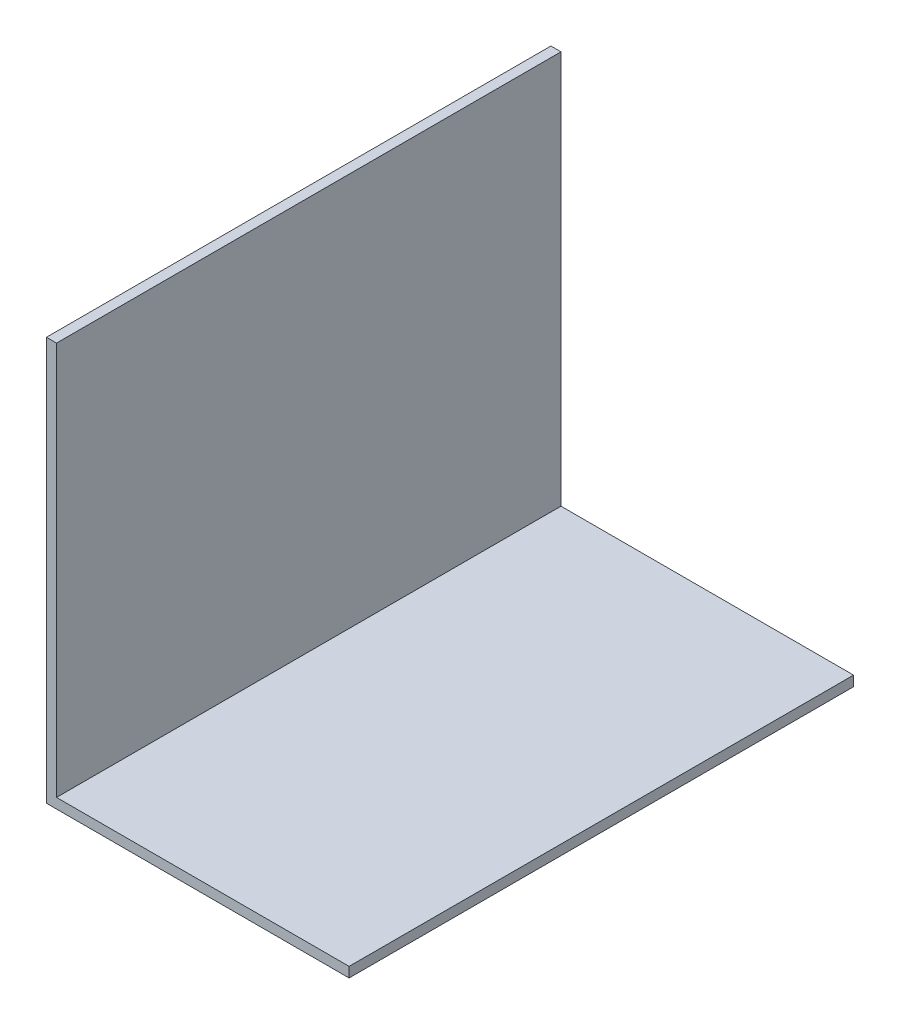
ISO-10303-21;
HEADER;
FILE_DESCRIPTION(('STEP AP214'),'2;1');
FILE_NAME('part.step','',(''),(''),'','','');
FILE_SCHEMA(('AUTOMOTIVE_DESIGN { 1 0 10303 214 1 1 1 1 }'));
ENDSEC;
DATA;
#1=APPLICATION_CONTEXT('core data for automotive mechanical design processes');
#2=APPLICATION_PROTOCOL_DEFINITION('international standard','automotive_design',2000,#1);
#3=PRODUCT_CONTEXT('',#1,'mechanical');
#4=PRODUCT('Part','Part','',(#3));
#5=PRODUCT_RELATED_PRODUCT_CATEGORY('part','',(#4));
#6=PRODUCT_DEFINITION_FORMATION('','',#4);
#7=PRODUCT_DEFINITION_CONTEXT('part definition',#1,'design');
#8=PRODUCT_DEFINITION('design','',#6,#7);
#9=PRODUCT_DEFINITION_SHAPE('','',#8);
#10=(LENGTH_UNIT() NAMED_UNIT(*) SI_UNIT(.MILLI.,.METRE.));
#11=(NAMED_UNIT(*) PLANE_ANGLE_UNIT() SI_UNIT($,.RADIAN.));
#12=(NAMED_UNIT(*) SI_UNIT($,.STERADIAN.) SOLID_ANGLE_UNIT());
#13=UNCERTAINTY_MEASURE_WITH_UNIT(LENGTH_MEASURE(1.E-05),#10,'distance_accuracy_value','');
#14=(GEOMETRIC_REPRESENTATION_CONTEXT(3) GLOBAL_UNCERTAINTY_ASSIGNED_CONTEXT((#13)) GLOBAL_UNIT_ASSIGNED_CONTEXT((#10,
#11,#12)) REPRESENTATION_CONTEXT('',''));
#15=CARTESIAN_POINT('',(0.,0.,0.));
#16=DIRECTION('',(0.,0.,1.));
#17=DIRECTION('',(1.,0.,0.));
#18=AXIS2_PLACEMENT_3D('',#15,#16,#17);
#19=CARTESIAN_POINT('',(-70.,200.,125.));
#20=DIRECTION('',(0.,-1.,0.));
#21=DIRECTION('',(0.,0.,-1.));
#22=AXIS2_PLACEMENT_3D('',#19,#20,#21);
#23=PLANE('',#22);
#24=DIRECTION('',(-1.,0.,0.));
#25=VECTOR('',#24,1.);
#26=CARTESIAN_POINT('',(-70.,200.,-125.));
#27=LINE('',#26,#25);
#28=CARTESIAN_POINT('',(-70.,200.,-125.));
#29=VERTEX_POINT('',#28);
#30=CARTESIAN_POINT('',(-75.,200.,-125.));
#31=VERTEX_POINT('',#30);
#32=EDGE_CURVE('E117',#29,#31,#27,.T.);
#33=ORIENTED_EDGE('',*,*,#32,.T.);
#34=DIRECTION('',(0.,0.,-1.));
#35=VECTOR('',#34,1.);
#36=CARTESIAN_POINT('',(-75.,200.,125.));
#37=LINE('',#36,#35);
#38=CARTESIAN_POINT('',(-75.,200.,125.));
#39=VERTEX_POINT('',#38);
#40=EDGE_CURVE('E11',#39,#31,#37,.T.);
#41=ORIENTED_EDGE('',*,*,#40,.F.);
#42=DIRECTION('',(-1.,0.,0.));
#43=VECTOR('',#42,1.);
#44=CARTESIAN_POINT('',(-70.,200.,125.));
#45=LINE('',#44,#43);
#46=CARTESIAN_POINT('',(-70.,200.,125.));
#47=VERTEX_POINT('',#46);
#48=EDGE_CURVE('E127',#47,#39,#45,.T.);
#49=ORIENTED_EDGE('',*,*,#48,.F.);
#50=DIRECTION('',(0.,0.,-1.));
#51=VECTOR('',#50,1.);
#52=CARTESIAN_POINT('',(-70.,200.,125.));
#53=LINE('',#52,#51);
#54=EDGE_CURVE('E113',#47,#29,#53,.T.);
#55=ORIENTED_EDGE('',*,*,#54,.T.);
#56=EDGE_LOOP('',(#33,#41,#49,#55));
#57=FACE_BOUND('',#56,.T.);
#58=ADVANCED_FACE('F33',(#57),#23,.F.);
#59=CARTESIAN_POINT('',(-75.,200.,125.));
#60=DIRECTION('',(1.,0.,0.));
#61=DIRECTION('',(0.,1.,0.));
#62=AXIS2_PLACEMENT_3D('',#59,#60,#61);
#63=PLANE('',#62);
#64=DIRECTION('',(0.,-1.,0.));
#65=VECTOR('',#64,1.);
#66=CARTESIAN_POINT('',(-75.,200.,-125.));
#67=LINE('',#66,#65);
#68=CARTESIAN_POINT('',(-75.,0.,-125.));
#69=VERTEX_POINT('',#68);
#70=EDGE_CURVE('E120',#31,#69,#67,.T.);
#71=ORIENTED_EDGE('',*,*,#70,.T.);
#72=DIRECTION('',(0.,0.,-1.));
#73=VECTOR('',#72,1.);
#74=CARTESIAN_POINT('',(-75.,0.,125.));
#75=LINE('',#74,#73);
#76=CARTESIAN_POINT('',(-75.,0.,125.));
#77=VERTEX_POINT('',#76);
#78=EDGE_CURVE('E41',#77,#69,#75,.T.);
#79=ORIENTED_EDGE('',*,*,#78,.F.);
#80=DIRECTION('',(0.,-1.,0.));
#81=VECTOR('',#80,1.);
#82=CARTESIAN_POINT('',(-75.,200.,125.));
#83=LINE('',#82,#81);
#84=EDGE_CURVE('E86',#39,#77,#83,.T.);
#85=ORIENTED_EDGE('',*,*,#84,.F.);
#86=ORIENTED_EDGE('',*,*,#40,.T.);
#87=EDGE_LOOP('',(#71,#79,#85,#86));
#88=FACE_BOUND('',#87,.T.);
#89=ADVANCED_FACE('F151',(#88),#63,.F.);
#90=CARTESIAN_POINT('',(-75.,0.,125.));
#91=DIRECTION('',(0.,1.,0.));
#92=DIRECTION('',(-1.,0.,0.));
#93=AXIS2_PLACEMENT_3D('',#90,#91,#92);
#94=PLANE('',#93);
#95=DIRECTION('',(1.,0.,0.));
#96=VECTOR('',#95,1.);
#97=CARTESIAN_POINT('',(-75.,0.,-125.));
#98=LINE('',#97,#96);
#99=CARTESIAN_POINT('',(75.,0.,-125.));
#100=VERTEX_POINT('',#99);
#101=EDGE_CURVE('E122',#69,#100,#98,.T.);
#102=ORIENTED_EDGE('',*,*,#101,.T.);
#103=DIRECTION('',(0.,0.,-1.));
#104=VECTOR('',#103,1.);
#105=CARTESIAN_POINT('',(75.,0.,125.));
#106=LINE('',#105,#104);
#107=CARTESIAN_POINT('',(75.,0.,125.));
#108=VERTEX_POINT('',#107);
#109=EDGE_CURVE('E108',#108,#100,#106,.T.);
#110=ORIENTED_EDGE('',*,*,#109,.F.);
#111=DIRECTION('',(1.,0.,0.));
#112=VECTOR('',#111,1.);
#113=CARTESIAN_POINT('',(-75.,0.,125.));
#114=LINE('',#113,#112);
#115=EDGE_CURVE('E99',#77,#108,#114,.T.);
#116=ORIENTED_EDGE('',*,*,#115,.F.);
#117=ORIENTED_EDGE('',*,*,#78,.T.);
#118=EDGE_LOOP('',(#102,#110,#116,#117));
#119=FACE_BOUND('',#118,.T.);
#120=ADVANCED_FACE('F133',(#119),#94,.F.);
#121=CARTESIAN_POINT('',(75.,5.,125.));
#122=DIRECTION('',(-1.,0.,0.));
#123=DIRECTION('',(0.,0.,1.));
#124=AXIS2_PLACEMENT_3D('',#121,#122,#123);
#125=PLANE('',#124);
#126=DIRECTION('',(0.,1.,0.));
#127=VECTOR('',#126,1.);
#128=CARTESIAN_POINT('',(75.,5.,-125.));
#129=LINE('',#128,#127);
#130=CARTESIAN_POINT('',(75.,5.,-125.));
#131=VERTEX_POINT('',#130);
#132=EDGE_CURVE('E107',#100,#131,#129,.T.);
#133=ORIENTED_EDGE('',*,*,#132,.T.);
#134=DIRECTION('',(0.,0.,-1.));
#135=VECTOR('',#134,1.);
#136=CARTESIAN_POINT('',(75.,5.,125.));
#137=LINE('',#136,#135);
#138=CARTESIAN_POINT('',(75.,5.,125.));
#139=VERTEX_POINT('',#138);
#140=EDGE_CURVE('E104',#139,#131,#137,.T.);
#141=ORIENTED_EDGE('',*,*,#140,.F.);
#142=DIRECTION('',(0.,1.,0.));
#143=VECTOR('',#142,1.);
#144=CARTESIAN_POINT('',(75.,5.,125.));
#145=LINE('',#144,#143);
#146=EDGE_CURVE('E93',#108,#139,#145,.T.);
#147=ORIENTED_EDGE('',*,*,#146,.F.);
#148=ORIENTED_EDGE('',*,*,#109,.T.);
#149=EDGE_LOOP('',(#133,#141,#147,#148));
#150=FACE_BOUND('',#149,.T.);
#151=ADVANCED_FACE('F105',(#150),#125,.F.);
#152=CARTESIAN_POINT('',(75.,5.,125.));
#153=DIRECTION('',(0.,-1.,0.));
#154=DIRECTION('',(1.,0.,0.));
#155=AXIS2_PLACEMENT_3D('',#152,#153,#154);
#156=PLANE('',#155);
#157=DIRECTION('',(-1.,0.,0.));
#158=VECTOR('',#157,1.);
#159=CARTESIAN_POINT('',(75.,5.,-125.));
#160=LINE('',#159,#158);
#161=CARTESIAN_POINT('',(-70.,4.99999999999999,-125.));
#162=VERTEX_POINT('',#161);
#163=EDGE_CURVE('E72',#131,#162,#160,.T.);
#164=ORIENTED_EDGE('',*,*,#163,.T.);
#165=DIRECTION('',(0.,0.,-1.));
#166=VECTOR('',#165,1.);
#167=CARTESIAN_POINT('',(-70.,4.99999999999999,125.));
#168=LINE('',#167,#166);
#169=CARTESIAN_POINT('',(-70.,4.99999999999999,125.));
#170=VERTEX_POINT('',#169);
#171=EDGE_CURVE('E109',#170,#162,#168,.T.);
#172=ORIENTED_EDGE('',*,*,#171,.F.);
#173=DIRECTION('',(-1.,0.,0.));
#174=VECTOR('',#173,1.);
#175=CARTESIAN_POINT('',(75.,5.,125.));
#176=LINE('',#175,#174);
#177=EDGE_CURVE('E97',#139,#170,#176,.T.);
#178=ORIENTED_EDGE('',*,*,#177,.F.);
#179=ORIENTED_EDGE('',*,*,#140,.T.);
#180=EDGE_LOOP('',(#164,#172,#178,#179));
#181=FACE_BOUND('',#180,.T.);
#182=ADVANCED_FACE('F111',(#181),#156,.F.);
#183=CARTESIAN_POINT('',(-70.,4.99999999999999,125.));
#184=DIRECTION('',(-1.,0.,0.));
#185=DIRECTION('',(0.,-1.,0.));
#186=AXIS2_PLACEMENT_3D('',#183,#184,#185);
#187=PLANE('',#186);
#188=DIRECTION('',(0.,1.,0.));
#189=VECTOR('',#188,1.);
#190=CARTESIAN_POINT('',(-70.,4.99999999999999,-125.));
#191=LINE('',#190,#189);
#192=EDGE_CURVE('E78',#162,#29,#191,.T.);
#193=ORIENTED_EDGE('',*,*,#192,.T.);
#194=ORIENTED_EDGE('',*,*,#54,.F.);
#195=DIRECTION('',(0.,1.,0.));
#196=VECTOR('',#195,1.);
#197=CARTESIAN_POINT('',(-70.,4.99999999999999,125.));
#198=LINE('',#197,#196);
#199=EDGE_CURVE('E49',#170,#47,#198,.T.);
#200=ORIENTED_EDGE('',*,*,#199,.F.);
#201=ORIENTED_EDGE('',*,*,#171,.T.);
#202=EDGE_LOOP('',(#193,#194,#200,#201));
#203=FACE_BOUND('',#202,.T.);
#204=ADVANCED_FACE('F140',(#203),#187,.F.);
#205=CARTESIAN_POINT('',(0.,0.,125.));
#206=DIRECTION('',(0.,0.,1.));
#207=DIRECTION('',(1.,0.,0.));
#208=AXIS2_PLACEMENT_3D('',#205,#206,#207);
#209=PLANE('',#208);
#210=ORIENTED_EDGE('',*,*,#48,.T.);
#211=ORIENTED_EDGE('',*,*,#84,.T.);
#212=ORIENTED_EDGE('',*,*,#115,.T.);
#213=ORIENTED_EDGE('',*,*,#146,.T.);
#214=ORIENTED_EDGE('',*,*,#177,.T.);
#215=ORIENTED_EDGE('',*,*,#199,.T.);
#216=EDGE_LOOP('',(#210,#211,#212,#213,#214,#215));
#217=FACE_BOUND('',#216,.T.);
#218=ADVANCED_FACE('F95',(#217),#209,.T.);
#219=CARTESIAN_POINT('',(0.,0.,-125.));
#220=DIRECTION('',(0.,0.,1.));
#221=DIRECTION('',(1.,0.,0.));
#222=AXIS2_PLACEMENT_3D('',#219,#220,#221);
#223=PLANE('',#222);
#224=ORIENTED_EDGE('',*,*,#32,.F.);
#225=ORIENTED_EDGE('',*,*,#192,.F.);
#226=ORIENTED_EDGE('',*,*,#163,.F.);
#227=ORIENTED_EDGE('',*,*,#132,.F.);
#228=ORIENTED_EDGE('',*,*,#101,.F.);
#229=ORIENTED_EDGE('',*,*,#70,.F.);
#230=EDGE_LOOP('',(#224,#225,#226,#227,#228,#229));
#231=FACE_BOUND('',#230,.T.);
#232=ADVANCED_FACE('F136',(#231),#223,.F.);
#233=CLOSED_SHELL('',(#58,#89,#120,#151,#182,#204,#218,#232));
#234=MANIFOLD_SOLID_BREP('B2',#233);
#235=ADVANCED_BREP_SHAPE_REPRESENTATION('',(#18,#234),#14);
#236=SHAPE_DEFINITION_REPRESENTATION(#9,#235);
ENDSEC;
END-ISO-10303-21;
